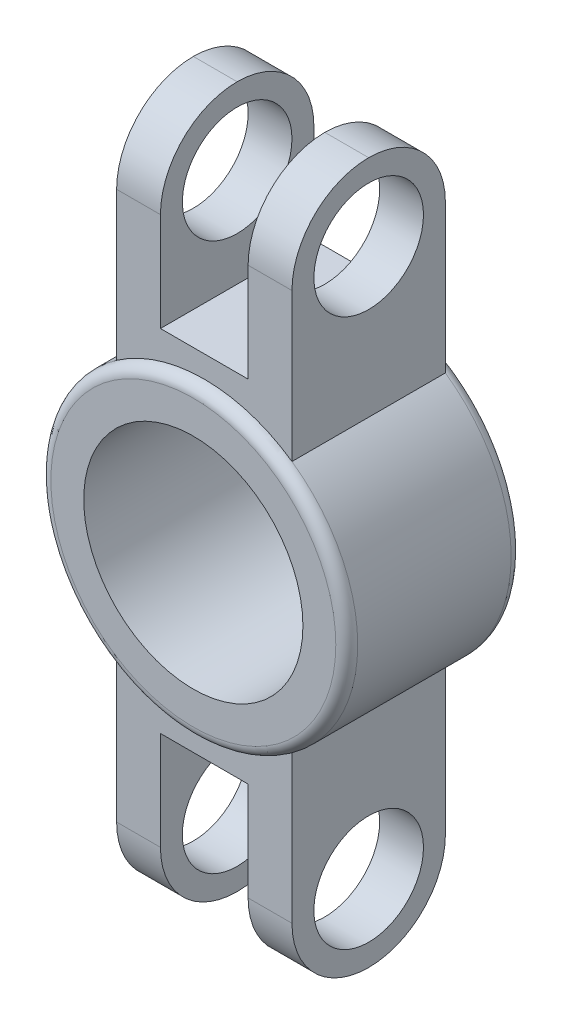
ISO-10303-21;
HEADER;
FILE_DESCRIPTION(('STEP AP214'),'2;1');
FILE_NAME('part.step','',(''),(''),'','','');
FILE_SCHEMA(('AUTOMOTIVE_DESIGN { 1 0 10303 214 1 1 1 1 }'));
ENDSEC;
DATA;
#1=APPLICATION_CONTEXT('core data for automotive mechanical design processes');
#2=APPLICATION_PROTOCOL_DEFINITION('international standard','automotive_design',2000,#1);
#3=PRODUCT_CONTEXT('',#1,'mechanical');
#4=PRODUCT('Part','Part','',(#3));
#5=PRODUCT_RELATED_PRODUCT_CATEGORY('part','',(#4));
#6=PRODUCT_DEFINITION_FORMATION('','',#4);
#7=PRODUCT_DEFINITION_CONTEXT('part definition',#1,'design');
#8=PRODUCT_DEFINITION('design','',#6,#7);
#9=PRODUCT_DEFINITION_SHAPE('','',#8);
#10=(LENGTH_UNIT() NAMED_UNIT(*) SI_UNIT(.MILLI.,.METRE.));
#11=(NAMED_UNIT(*) PLANE_ANGLE_UNIT() SI_UNIT($,.RADIAN.));
#12=(NAMED_UNIT(*) SI_UNIT($,.STERADIAN.) SOLID_ANGLE_UNIT());
#13=UNCERTAINTY_MEASURE_WITH_UNIT(LENGTH_MEASURE(1.E-05),#10,'distance_accuracy_value','');
#14=(GEOMETRIC_REPRESENTATION_CONTEXT(3) GLOBAL_UNCERTAINTY_ASSIGNED_CONTEXT((#13)) GLOBAL_UNIT_ASSIGNED_CONTEXT((#10,
#11,#12)) REPRESENTATION_CONTEXT('',''));
#15=CARTESIAN_POINT('',(0.,0.,0.));
#16=DIRECTION('',(0.,0.,1.));
#17=DIRECTION('',(1.,0.,0.));
#18=AXIS2_PLACEMENT_3D('',#15,#16,#17);
#19=CARTESIAN_POINT('',(5.08,-6.985,4.445));
#20=DIRECTION('',(-1.,0.,0.));
#21=DIRECTION('',(0.,0.,1.));
#22=AXIS2_PLACEMENT_3D('',#19,#20,#21);
#23=PLANE('',#22);
#24=CARTESIAN_POINT('',(5.08,-15.875,0.));
#25=DIRECTION('',(-1.,0.,0.));
#26=DIRECTION('',(0.,0.,1.));
#27=AXIS2_PLACEMENT_3D('',#24,#25,#26);
#28=CIRCLE('',#27,4.445);
#29=CARTESIAN_POINT('',(5.08,-15.875,4.445));
#30=VERTEX_POINT('',#29);
#31=CARTESIAN_POINT('',(5.08,-20.32,0.));
#32=VERTEX_POINT('',#31);
#33=EDGE_CURVE('E43',#30,#32,#28,.F.);
#34=ORIENTED_EDGE('',*,*,#33,.T.);
#35=CARTESIAN_POINT('',(5.08,-15.875,0.));
#36=DIRECTION('',(-1.,0.,0.));
#37=DIRECTION('',(0.,0.,1.));
#38=AXIS2_PLACEMENT_3D('',#35,#36,#37);
#39=CIRCLE('',#38,4.445);
#40=CARTESIAN_POINT('',(5.08,-15.875,-4.445));
#41=VERTEX_POINT('',#40);
#42=EDGE_CURVE('E11',#32,#41,#39,.F.);
#43=ORIENTED_EDGE('',*,*,#42,.T.);
#44=DIRECTION('',(0.,-1.,0.));
#45=VECTOR('',#44,1.);
#46=CARTESIAN_POINT('',(5.08,-6.985,-4.445));
#47=LINE('',#46,#45);
#48=CARTESIAN_POINT('',(5.08,-7.2955945611033,-4.445));
#49=VERTEX_POINT('',#48);
#50=EDGE_CURVE('E192',#49,#41,#47,.T.);
#51=ORIENTED_EDGE('',*,*,#50,.F.);
#52=DIRECTION('',(0.,0.,-1.));
#53=VECTOR('',#52,1.);
#54=CARTESIAN_POINT('',(5.08,-7.2955945611033,5.08));
#55=LINE('',#54,#53);
#56=CARTESIAN_POINT('',(5.08,-7.2955945611033,4.445));
#57=VERTEX_POINT('',#56);
#58=EDGE_CURVE('E191',#49,#57,#55,.F.);
#59=ORIENTED_EDGE('',*,*,#58,.T.);
#60=DIRECTION('',(0.,-1.,0.));
#61=VECTOR('',#60,1.);
#62=CARTESIAN_POINT('',(5.08,-6.985,4.445));
#63=LINE('',#62,#61);
#64=EDGE_CURVE('E198',#57,#30,#63,.T.);
#65=ORIENTED_EDGE('',*,*,#64,.T.);
#66=EDGE_LOOP('',(#34,#43,#51,#59,#65));
#67=FACE_BOUND('',#66,.T.);
#68=CARTESIAN_POINT('',(5.08,-15.875,0.));
#69=DIRECTION('',(-1.,0.,0.));
#70=DIRECTION('',(0.,0.,-1.));
#71=AXIS2_PLACEMENT_3D('',#68,#69,#70);
#72=CIRCLE('',#71,3.175);
#73=CARTESIAN_POINT('',(5.08,-15.875,-3.175));
#74=VERTEX_POINT('',#73);
#75=EDGE_CURVE('E347',#74,#74,#72,.T.);
#76=ORIENTED_EDGE('',*,*,#75,.T.);
#77=EDGE_LOOP('',(#76));
#78=FACE_BOUND('',#77,.T.);
#79=ADVANCED_FACE('F34',(#67,#78),#23,.F.);
#80=CARTESIAN_POINT('',(2.54,-6.985,4.445));
#81=DIRECTION('',(1.,0.,0.));
#82=DIRECTION('',(0.,0.,-1.));
#83=AXIS2_PLACEMENT_3D('',#80,#81,#82);
#84=PLANE('',#83);
#85=DIRECTION('',(0.,-1.,0.));
#86=VECTOR('',#85,1.);
#87=CARTESIAN_POINT('',(2.54,-6.985,-4.445));
#88=LINE('',#87,#86);
#89=CARTESIAN_POINT('',(2.54,-10.16,-4.445));
#90=VERTEX_POINT('',#89);
#91=CARTESIAN_POINT('',(2.54,-15.875,-4.445));
#92=VERTEX_POINT('',#91);
#93=EDGE_CURVE('E197',#90,#92,#88,.T.);
#94=ORIENTED_EDGE('',*,*,#93,.T.);
#95=CARTESIAN_POINT('',(2.54,-15.875,0.));
#96=DIRECTION('',(1.,0.,0.));
#97=DIRECTION('',(0.,0.,-1.));
#98=AXIS2_PLACEMENT_3D('',#95,#96,#97);
#99=CIRCLE('',#98,4.445);
#100=CARTESIAN_POINT('',(2.54,-20.32,0.));
#101=VERTEX_POINT('',#100);
#102=EDGE_CURVE('E57',#92,#101,#99,.F.);
#103=ORIENTED_EDGE('',*,*,#102,.T.);
#104=CARTESIAN_POINT('',(2.54,-15.875,0.));
#105=DIRECTION('',(1.,0.,0.));
#106=DIRECTION('',(0.,0.,-1.));
#107=AXIS2_PLACEMENT_3D('',#104,#105,#106);
#108=CIRCLE('',#107,4.445);
#109=CARTESIAN_POINT('',(2.54,-15.875,4.445));
#110=VERTEX_POINT('',#109);
#111=EDGE_CURVE('E196',#101,#110,#108,.F.);
#112=ORIENTED_EDGE('',*,*,#111,.T.);
#113=DIRECTION('',(0.,-1.,0.));
#114=VECTOR('',#113,1.);
#115=CARTESIAN_POINT('',(2.54,-6.985,4.445));
#116=LINE('',#115,#114);
#117=CARTESIAN_POINT('',(2.54,-10.16,4.445));
#118=VERTEX_POINT('',#117);
#119=EDGE_CURVE('E177',#118,#110,#116,.T.);
#120=ORIENTED_EDGE('',*,*,#119,.F.);
#121=DIRECTION('',(0.,0.,1.));
#122=VECTOR('',#121,1.);
#123=CARTESIAN_POINT('',(2.54,-10.16,4.445));
#124=LINE('',#123,#122);
#125=EDGE_CURVE('E187',#90,#118,#124,.T.);
#126=ORIENTED_EDGE('',*,*,#125,.F.);
#127=EDGE_LOOP('',(#94,#103,#112,#120,#126));
#128=FACE_BOUND('',#127,.T.);
#129=CARTESIAN_POINT('',(2.54,-15.875,0.));
#130=DIRECTION('',(1.,0.,0.));
#131=DIRECTION('',(0.,0.,-1.));
#132=AXIS2_PLACEMENT_3D('',#129,#130,#131);
#133=CIRCLE('',#132,3.175);
#134=CARTESIAN_POINT('',(2.54,-15.875,-3.175));
#135=VERTEX_POINT('',#134);
#136=EDGE_CURVE('E336',#135,#135,#133,.F.);
#137=ORIENTED_EDGE('',*,*,#136,.F.);
#138=EDGE_LOOP('',(#137));
#139=FACE_BOUND('',#138,.T.);
#140=ADVANCED_FACE('F194',(#128,#139),#84,.F.);
#141=CARTESIAN_POINT('',(-5.08,-6.985,4.445));
#142=DIRECTION('',(1.,0.,0.));
#143=DIRECTION('',(0.,0.,-1.));
#144=AXIS2_PLACEMENT_3D('',#141,#142,#143);
#145=PLANE('',#144);
#146=DIRECTION('',(0.,-1.,0.));
#147=VECTOR('',#146,1.);
#148=CARTESIAN_POINT('',(-5.08,-6.985,-4.445));
#149=LINE('',#148,#147);
#150=CARTESIAN_POINT('',(-5.08,-7.29559456110329,-4.445));
#151=VERTEX_POINT('',#150);
#152=CARTESIAN_POINT('',(-5.08,-15.875,-4.445));
#153=VERTEX_POINT('',#152);
#154=EDGE_CURVE('E353',#151,#153,#149,.T.);
#155=ORIENTED_EDGE('',*,*,#154,.T.);
#156=CARTESIAN_POINT('',(-5.08,-15.875,0.));
#157=DIRECTION('',(1.,0.,0.));
#158=DIRECTION('',(0.,0.,-1.));
#159=AXIS2_PLACEMENT_3D('',#156,#157,#158);
#160=CIRCLE('',#159,4.445);
#161=CARTESIAN_POINT('',(-5.08,-20.32,0.));
#162=VERTEX_POINT('',#161);
#163=EDGE_CURVE('E319',#153,#162,#160,.F.);
#164=ORIENTED_EDGE('',*,*,#163,.T.);
#165=CARTESIAN_POINT('',(-5.08,-15.875,0.));
#166=DIRECTION('',(1.,0.,0.));
#167=DIRECTION('',(0.,0.,-1.));
#168=AXIS2_PLACEMENT_3D('',#165,#166,#167);
#169=CIRCLE('',#168,4.445);
#170=CARTESIAN_POINT('',(-5.08,-15.875,4.445));
#171=VERTEX_POINT('',#170);
#172=EDGE_CURVE('E317',#162,#171,#169,.F.);
#173=ORIENTED_EDGE('',*,*,#172,.T.);
#174=DIRECTION('',(0.,-1.,0.));
#175=VECTOR('',#174,1.);
#176=CARTESIAN_POINT('',(-5.08,-6.985,4.445));
#177=LINE('',#176,#175);
#178=CARTESIAN_POINT('',(-5.08,-7.29559456110329,4.445));
#179=VERTEX_POINT('',#178);
#180=EDGE_CURVE('E356',#179,#171,#177,.T.);
#181=ORIENTED_EDGE('',*,*,#180,.F.);
#182=DIRECTION('',(0.,0.,-1.));
#183=VECTOR('',#182,1.);
#184=CARTESIAN_POINT('',(-5.08,-7.29559456110329,5.08));
#185=LINE('',#184,#183);
#186=EDGE_CURVE('E201',#179,#151,#185,.T.);
#187=ORIENTED_EDGE('',*,*,#186,.T.);
#188=EDGE_LOOP('',(#155,#164,#173,#181,#187));
#189=FACE_BOUND('',#188,.T.);
#190=CARTESIAN_POINT('',(-5.08,-15.875,0.));
#191=DIRECTION('',(-1.,0.,0.));
#192=DIRECTION('',(0.,0.,-1.));
#193=AXIS2_PLACEMENT_3D('',#190,#191,#192);
#194=CIRCLE('',#193,3.175);
#195=CARTESIAN_POINT('',(-5.08,-15.875,-3.175));
#196=VERTEX_POINT('',#195);
#197=EDGE_CURVE('E344',#196,#196,#194,.T.);
#198=ORIENTED_EDGE('',*,*,#197,.F.);
#199=EDGE_LOOP('',(#198));
#200=FACE_BOUND('',#199,.T.);
#201=ADVANCED_FACE('F382',(#189,#200),#145,.F.);
#202=CARTESIAN_POINT('',(-2.54,-6.985,4.445));
#203=DIRECTION('',(-1.,0.,0.));
#204=DIRECTION('',(0.,0.,1.));
#205=AXIS2_PLACEMENT_3D('',#202,#203,#204);
#206=PLANE('',#205);
#207=CARTESIAN_POINT('',(-2.54,-15.875,0.));
#208=DIRECTION('',(-1.,0.,0.));
#209=DIRECTION('',(0.,0.,1.));
#210=AXIS2_PLACEMENT_3D('',#207,#208,#209);
#211=CIRCLE('',#210,4.445);
#212=CARTESIAN_POINT('',(-2.54,-15.875,4.445));
#213=VERTEX_POINT('',#212);
#214=CARTESIAN_POINT('',(-2.54,-20.32,0.));
#215=VERTEX_POINT('',#214);
#216=EDGE_CURVE('E321',#213,#215,#211,.F.);
#217=ORIENTED_EDGE('',*,*,#216,.T.);
#218=CARTESIAN_POINT('',(-2.54,-15.875,0.));
#219=DIRECTION('',(-1.,0.,0.));
#220=DIRECTION('',(0.,0.,1.));
#221=AXIS2_PLACEMENT_3D('',#218,#219,#220);
#222=CIRCLE('',#221,4.445);
#223=CARTESIAN_POINT('',(-2.54,-15.875,-4.445));
#224=VERTEX_POINT('',#223);
#225=EDGE_CURVE('E323',#215,#224,#222,.F.);
#226=ORIENTED_EDGE('',*,*,#225,.T.);
#227=DIRECTION('',(0.,-1.,0.));
#228=VECTOR('',#227,1.);
#229=CARTESIAN_POINT('',(-2.54,-6.985,-4.445));
#230=LINE('',#229,#228);
#231=CARTESIAN_POINT('',(-2.54,-10.16,-4.445));
#232=VERTEX_POINT('',#231);
#233=EDGE_CURVE('E349',#232,#224,#230,.T.);
#234=ORIENTED_EDGE('',*,*,#233,.F.);
#235=DIRECTION('',(0.,0.,-1.));
#236=VECTOR('',#235,1.);
#237=CARTESIAN_POINT('',(-2.54,-10.16,4.445));
#238=LINE('',#237,#236);
#239=CARTESIAN_POINT('',(-2.54,-10.16,4.445));
#240=VERTEX_POINT('',#239);
#241=EDGE_CURVE('E352',#240,#232,#238,.T.);
#242=ORIENTED_EDGE('',*,*,#241,.F.);
#243=DIRECTION('',(0.,-1.,0.));
#244=VECTOR('',#243,1.);
#245=CARTESIAN_POINT('',(-2.54,-6.985,4.445));
#246=LINE('',#245,#244);
#247=EDGE_CURVE('E180',#240,#213,#246,.T.);
#248=ORIENTED_EDGE('',*,*,#247,.T.);
#249=EDGE_LOOP('',(#217,#226,#234,#242,#248));
#250=FACE_BOUND('',#249,.T.);
#251=CARTESIAN_POINT('',(-2.54,-15.875,0.));
#252=DIRECTION('',(-1.,0.,0.));
#253=DIRECTION('',(0.,0.,1.));
#254=AXIS2_PLACEMENT_3D('',#251,#252,#253);
#255=CIRCLE('',#254,3.175);
#256=CARTESIAN_POINT('',(-2.54,-15.875,3.175));
#257=VERTEX_POINT('',#256);
#258=EDGE_CURVE('E38',#257,#257,#255,.F.);
#259=ORIENTED_EDGE('',*,*,#258,.F.);
#260=EDGE_LOOP('',(#259));
#261=FACE_BOUND('',#260,.T.);
#262=ADVANCED_FACE('F384',(#250,#261),#206,.F.);
#263=CARTESIAN_POINT('',(3.81,-10.16,4.445));
#264=DIRECTION('',(0.,-1.,0.));
#265=DIRECTION('',(0.,0.,-1.));
#266=AXIS2_PLACEMENT_3D('',#263,#264,#265);
#267=PLANE('',#266);
#268=DIRECTION('',(-1.,0.,0.));
#269=VECTOR('',#268,1.);
#270=CARTESIAN_POINT('',(3.81,-10.16,4.445));
#271=LINE('',#270,#269);
#272=EDGE_CURVE('E172',#118,#240,#271,.T.);
#273=ORIENTED_EDGE('',*,*,#272,.T.);
#274=ORIENTED_EDGE('',*,*,#241,.T.);
#275=DIRECTION('',(-1.,0.,0.));
#276=VECTOR('',#275,1.);
#277=CARTESIAN_POINT('',(3.81,-10.16,-4.445));
#278=LINE('',#277,#276);
#279=EDGE_CURVE('E184',#90,#232,#278,.T.);
#280=ORIENTED_EDGE('',*,*,#279,.F.);
#281=ORIENTED_EDGE('',*,*,#125,.T.);
#282=EDGE_LOOP('',(#273,#274,#280,#281));
#283=FACE_BOUND('',#282,.T.);
#284=ADVANCED_FACE('F188',(#283),#267,.T.);
#285=CARTESIAN_POINT('',(0.,0.,5.08));
#286=DIRECTION('',(0.,0.,-1.));
#287=DIRECTION('',(-1.,0.,0.));
#288=AXIS2_PLACEMENT_3D('',#285,#286,#287);
#289=CYLINDRICAL_SURFACE('',#288,8.89);
#290=ORIENTED_EDGE('',*,*,#186,.F.);
#291=CARTESIAN_POINT('',(0.,0.,4.445));
#292=DIRECTION('',(0.,0.,1.));
#293=DIRECTION('',(1.,0.,0.));
#294=AXIS2_PLACEMENT_3D('',#291,#292,#293);
#295=CIRCLE('',#294,8.89);
#296=CARTESIAN_POINT('',(-5.08,7.29559456110329,4.445));
#297=VERTEX_POINT('',#296);
#298=EDGE_CURVE('E258',#179,#297,#295,.F.);
#299=ORIENTED_EDGE('',*,*,#298,.T.);
#300=DIRECTION('',(0.,0.,-1.));
#301=VECTOR('',#300,1.);
#302=CARTESIAN_POINT('',(-5.08,7.29559456110329,5.08));
#303=LINE('',#302,#301);
#304=CARTESIAN_POINT('',(-5.08,7.29559456110329,-4.445));
#305=VERTEX_POINT('',#304);
#306=EDGE_CURVE('E221',#297,#305,#303,.T.);
#307=ORIENTED_EDGE('',*,*,#306,.T.);
#308=CARTESIAN_POINT('',(0.,0.,-4.445));
#309=DIRECTION('',(0.,0.,1.));
#310=DIRECTION('',(1.,0.,0.));
#311=AXIS2_PLACEMENT_3D('',#308,#309,#310);
#312=CIRCLE('',#311,8.89);
#313=EDGE_CURVE('E268',#305,#151,#312,.T.);
#314=ORIENTED_EDGE('',*,*,#313,.T.);
#315=EDGE_LOOP('',(#290,#299,#307,#314));
#316=FACE_BOUND('',#315,.T.);
#317=ADVANCED_FACE('F402',(#316),#289,.T.);
#318=ORIENTED_EDGE('',*,*,#58,.F.);
#319=CARTESIAN_POINT('',(5.08,7.2955945611033,-4.445));
#320=VERTEX_POINT('',#319);
#321=EDGE_CURVE('E263',#49,#320,#312,.T.);
#322=ORIENTED_EDGE('',*,*,#321,.T.);
#323=DIRECTION('',(0.,0.,-1.));
#324=VECTOR('',#323,1.);
#325=CARTESIAN_POINT('',(5.08,7.2955945611033,5.08));
#326=LINE('',#325,#324);
#327=CARTESIAN_POINT('',(5.08,7.2955945611033,4.445));
#328=VERTEX_POINT('',#327);
#329=EDGE_CURVE('E238',#320,#328,#326,.F.);
#330=ORIENTED_EDGE('',*,*,#329,.T.);
#331=EDGE_CURVE('E264',#328,#57,#295,.F.);
#332=ORIENTED_EDGE('',*,*,#331,.T.);
#333=EDGE_LOOP('',(#318,#322,#330,#332));
#334=FACE_BOUND('',#333,.T.);
#335=ADVANCED_FACE('F450',(#334),#289,.T.);
#336=CARTESIAN_POINT('',(0.,0.,5.08));
#337=DIRECTION('',(0.,0.,1.));
#338=DIRECTION('',(1.,0.,0.));
#339=AXIS2_PLACEMENT_3D('',#336,#337,#338);
#340=PLANE('',#339);
#341=CARTESIAN_POINT('',(0.,0.,5.08));
#342=DIRECTION('',(0.,0.,1.));
#343=DIRECTION('',(1.,0.,0.));
#344=AXIS2_PLACEMENT_3D('',#341,#342,#343);
#345=CIRCLE('',#344,8.255);
#346=CARTESIAN_POINT('',(8.255,0.,5.08));
#347=VERTEX_POINT('',#346);
#348=EDGE_CURVE('E271',#347,#347,#345,.T.);
#349=ORIENTED_EDGE('',*,*,#348,.T.);
#350=EDGE_LOOP('',(#349));
#351=FACE_BOUND('',#350,.T.);
#352=CARTESIAN_POINT('',(0.,0.,5.08));
#353=DIRECTION('',(0.,0.,1.));
#354=DIRECTION('',(1.,0.,0.));
#355=AXIS2_PLACEMENT_3D('',#352,#353,#354);
#356=CIRCLE('',#355,6.35);
#357=CARTESIAN_POINT('',(6.35,0.,5.08));
#358=VERTEX_POINT('',#357);
#359=EDGE_CURVE('E255',#358,#358,#356,.T.);
#360=ORIENTED_EDGE('',*,*,#359,.F.);
#361=EDGE_LOOP('',(#360));
#362=FACE_BOUND('',#361,.T.);
#363=ADVANCED_FACE('F447',(#351,#362),#340,.T.);
#364=CARTESIAN_POINT('',(0.,0.,-5.08));
#365=DIRECTION('',(0.,0.,1.));
#366=DIRECTION('',(1.,0.,0.));
#367=AXIS2_PLACEMENT_3D('',#364,#365,#366);
#368=PLANE('',#367);
#369=CARTESIAN_POINT('',(0.,0.,-5.08));
#370=DIRECTION('',(0.,0.,1.));
#371=DIRECTION('',(1.,0.,0.));
#372=AXIS2_PLACEMENT_3D('',#369,#370,#371);
#373=CIRCLE('',#372,8.255);
#374=CARTESIAN_POINT('',(8.255,0.,-5.08));
#375=VERTEX_POINT('',#374);
#376=EDGE_CURVE('E267',#375,#375,#373,.F.);
#377=ORIENTED_EDGE('',*,*,#376,.T.);
#378=EDGE_LOOP('',(#377));
#379=FACE_BOUND('',#378,.T.);
#380=CARTESIAN_POINT('',(0.,0.,-5.08));
#381=DIRECTION('',(0.,0.,1.));
#382=DIRECTION('',(1.,0.,0.));
#383=AXIS2_PLACEMENT_3D('',#380,#381,#382);
#384=CIRCLE('',#383,6.35);
#385=CARTESIAN_POINT('',(6.35,0.,-5.08));
#386=VERTEX_POINT('',#385);
#387=EDGE_CURVE('E254',#386,#386,#384,.T.);
#388=ORIENTED_EDGE('',*,*,#387,.T.);
#389=EDGE_LOOP('',(#388));
#390=FACE_BOUND('',#389,.T.);
#391=ADVANCED_FACE('F445',(#379,#390),#368,.F.);
#392=CARTESIAN_POINT('',(0.,0.,5.08));
#393=DIRECTION('',(0.,0.,-1.));
#394=DIRECTION('',(-1.,0.,0.));
#395=AXIS2_PLACEMENT_3D('',#392,#393,#394);
#396=CYLINDRICAL_SURFACE('',#395,6.35);
#397=ORIENTED_EDGE('',*,*,#359,.T.);
#398=EDGE_LOOP('',(#397));
#399=FACE_BOUND('',#398,.T.);
#400=ORIENTED_EDGE('',*,*,#387,.F.);
#401=EDGE_LOOP('',(#400));
#402=FACE_BOUND('',#401,.T.);
#403=ADVANCED_FACE('F441',(#399,#402),#396,.F.);
#404=CARTESIAN_POINT('',(0.,0.,-4.445));
#405=DIRECTION('',(0.,0.,1.));
#406=DIRECTION('',(1.,0.,0.));
#407=AXIS2_PLACEMENT_3D('',#404,#405,#406);
#408=TOROIDAL_SURFACE('',#407,8.255,0.635);
#409=ORIENTED_EDGE('',*,*,#376,.F.);
#410=EDGE_LOOP('',(#409));
#411=FACE_BOUND('',#410,.T.);
#412=EDGE_CURVE('E265',#320,#305,#312,.T.);
#413=ORIENTED_EDGE('',*,*,#412,.F.);
#414=ORIENTED_EDGE('',*,*,#321,.F.);
#415=EDGE_CURVE('E367',#151,#49,#312,.T.);
#416=ORIENTED_EDGE('',*,*,#415,.F.);
#417=ORIENTED_EDGE('',*,*,#313,.F.);
#418=EDGE_LOOP('',(#413,#414,#416,#417));
#419=FACE_BOUND('',#418,.T.);
#420=ADVANCED_FACE('F444',(#411,#419),#408,.T.);
#421=CARTESIAN_POINT('',(0.,0.,4.445));
#422=DIRECTION('',(0.,0.,1.));
#423=DIRECTION('',(1.,0.,0.));
#424=AXIS2_PLACEMENT_3D('',#421,#422,#423);
#425=TOROIDAL_SURFACE('',#424,8.255,0.635);
#426=EDGE_CURVE('E261',#297,#328,#295,.F.);
#427=ORIENTED_EDGE('',*,*,#426,.F.);
#428=ORIENTED_EDGE('',*,*,#298,.F.);
#429=EDGE_CURVE('E516',#57,#179,#295,.F.);
#430=ORIENTED_EDGE('',*,*,#429,.F.);
#431=ORIENTED_EDGE('',*,*,#331,.F.);
#432=EDGE_LOOP('',(#427,#428,#430,#431));
#433=FACE_BOUND('',#432,.T.);
#434=ORIENTED_EDGE('',*,*,#348,.F.);
#435=EDGE_LOOP('',(#434));
#436=FACE_BOUND('',#435,.T.);
#437=ADVANCED_FACE('F439',(#433,#436),#425,.T.);
#438=CARTESIAN_POINT('',(3.81,6.35,4.445));
#439=DIRECTION('',(0.,0.,-1.));
#440=DIRECTION('',(-1.,0.,0.));
#441=AXIS2_PLACEMENT_3D('',#438,#439,#440);
#442=PLANE('',#441);
#443=DIRECTION('',(0.,1.,0.));
#444=VECTOR('',#443,1.);
#445=CARTESIAN_POINT('',(-2.54,6.985,4.445));
#446=LINE('',#445,#444);
#447=CARTESIAN_POINT('',(-2.54,10.16,4.445));
#448=VERTEX_POINT('',#447);
#449=CARTESIAN_POINT('',(-2.54,15.875,4.445));
#450=VERTEX_POINT('',#449);
#451=EDGE_CURVE('E218',#448,#450,#446,.T.);
#452=ORIENTED_EDGE('',*,*,#451,.T.);
#453=DIRECTION('',(1.,0.,0.));
#454=VECTOR('',#453,1.);
#455=CARTESIAN_POINT('',(3.81,15.875,4.445));
#456=LINE('',#455,#454);
#457=CARTESIAN_POINT('',(-5.08,15.875,4.445));
#458=VERTEX_POINT('',#457);
#459=EDGE_CURVE('E295',#450,#458,#456,.F.);
#460=ORIENTED_EDGE('',*,*,#459,.T.);
#461=DIRECTION('',(0.,1.,0.));
#462=VECTOR('',#461,1.);
#463=CARTESIAN_POINT('',(-5.08,6.985,4.445));
#464=LINE('',#463,#462);
#465=EDGE_CURVE('E222',#297,#458,#464,.T.);
#466=ORIENTED_EDGE('',*,*,#465,.F.);
#467=ORIENTED_EDGE('',*,*,#426,.T.);
#468=DIRECTION('',(0.,1.,0.));
#469=VECTOR('',#468,1.);
#470=CARTESIAN_POINT('',(5.08,6.985,4.445));
#471=LINE('',#470,#469);
#472=CARTESIAN_POINT('',(5.08,15.875,4.445));
#473=VERTEX_POINT('',#472);
#474=EDGE_CURVE('E235',#328,#473,#471,.T.);
#475=ORIENTED_EDGE('',*,*,#474,.T.);
#476=DIRECTION('',(1.,0.,0.));
#477=VECTOR('',#476,1.);
#478=CARTESIAN_POINT('',(3.81,15.875,4.445));
#479=LINE('',#478,#477);
#480=CARTESIAN_POINT('',(2.54,15.875,4.445));
#481=VERTEX_POINT('',#480);
#482=EDGE_CURVE('E293',#473,#481,#479,.F.);
#483=ORIENTED_EDGE('',*,*,#482,.T.);
#484=DIRECTION('',(0.,1.,0.));
#485=VECTOR('',#484,1.);
#486=CARTESIAN_POINT('',(2.54,6.985,4.445));
#487=LINE('',#486,#485);
#488=CARTESIAN_POINT('',(2.54,10.16,4.445));
#489=VERTEX_POINT('',#488);
#490=EDGE_CURVE('E239',#489,#481,#487,.T.);
#491=ORIENTED_EDGE('',*,*,#490,.F.);
#492=DIRECTION('',(-1.,0.,0.));
#493=VECTOR('',#492,1.);
#494=CARTESIAN_POINT('',(3.81,10.16,4.445));
#495=LINE('',#494,#493);
#496=EDGE_CURVE('E249',#489,#448,#495,.T.);
#497=ORIENTED_EDGE('',*,*,#496,.T.);
#498=EDGE_LOOP('',(#452,#460,#466,#467,#475,#483,#491,#497));
#499=FACE_BOUND('',#498,.T.);
#500=ADVANCED_FACE('F435',(#499),#442,.F.);
#501=CARTESIAN_POINT('',(3.81,6.35,-4.445));
#502=DIRECTION('',(0.,0.,1.));
#503=DIRECTION('',(1.,0.,0.));
#504=AXIS2_PLACEMENT_3D('',#501,#502,#503);
#505=PLANE('',#504);
#506=DIRECTION('',(0.,1.,0.));
#507=VECTOR('',#506,1.);
#508=CARTESIAN_POINT('',(-5.08,6.985,-4.445));
#509=LINE('',#508,#507);
#510=CARTESIAN_POINT('',(-5.08,15.875,-4.445));
#511=VERTEX_POINT('',#510);
#512=EDGE_CURVE('E225',#305,#511,#509,.T.);
#513=ORIENTED_EDGE('',*,*,#512,.T.);
#514=DIRECTION('',(-1.,0.,0.));
#515=VECTOR('',#514,1.);
#516=CARTESIAN_POINT('',(3.81,15.875,-4.445));
#517=LINE('',#516,#515);
#518=CARTESIAN_POINT('',(-2.54,15.875,-4.445));
#519=VERTEX_POINT('',#518);
#520=EDGE_CURVE('E286',#511,#519,#517,.F.);
#521=ORIENTED_EDGE('',*,*,#520,.T.);
#522=DIRECTION('',(0.,1.,0.));
#523=VECTOR('',#522,1.);
#524=CARTESIAN_POINT('',(-2.54,6.985,-4.445));
#525=LINE('',#524,#523);
#526=CARTESIAN_POINT('',(-2.54,10.16,-4.445));
#527=VERTEX_POINT('',#526);
#528=EDGE_CURVE('E228',#527,#519,#525,.T.);
#529=ORIENTED_EDGE('',*,*,#528,.F.);
#530=DIRECTION('',(-1.,0.,0.));
#531=VECTOR('',#530,1.);
#532=CARTESIAN_POINT('',(3.81,10.16,-4.445));
#533=LINE('',#532,#531);
#534=CARTESIAN_POINT('',(2.54,10.16,-4.445));
#535=VERTEX_POINT('',#534);
#536=EDGE_CURVE('E252',#535,#527,#533,.T.);
#537=ORIENTED_EDGE('',*,*,#536,.F.);
#538=DIRECTION('',(0.,1.,0.));
#539=VECTOR('',#538,1.);
#540=CARTESIAN_POINT('',(2.54,6.985,-4.445));
#541=LINE('',#540,#539);
#542=CARTESIAN_POINT('',(2.54,15.875,-4.445));
#543=VERTEX_POINT('',#542);
#544=EDGE_CURVE('E242',#535,#543,#541,.T.);
#545=ORIENTED_EDGE('',*,*,#544,.T.);
#546=DIRECTION('',(-1.,0.,0.));
#547=VECTOR('',#546,1.);
#548=CARTESIAN_POINT('',(3.81,15.875,-4.445));
#549=LINE('',#548,#547);
#550=CARTESIAN_POINT('',(5.08,15.875,-4.445));
#551=VERTEX_POINT('',#550);
#552=EDGE_CURVE('E283',#543,#551,#549,.F.);
#553=ORIENTED_EDGE('',*,*,#552,.T.);
#554=DIRECTION('',(0.,1.,0.));
#555=VECTOR('',#554,1.);
#556=CARTESIAN_POINT('',(5.08,6.985,-4.445));
#557=LINE('',#556,#555);
#558=EDGE_CURVE('E234',#320,#551,#557,.T.);
#559=ORIENTED_EDGE('',*,*,#558,.F.);
#560=ORIENTED_EDGE('',*,*,#412,.T.);
#561=EDGE_LOOP('',(#513,#521,#529,#537,#545,#553,#559,#560));
#562=FACE_BOUND('',#561,.T.);
#563=ADVANCED_FACE('F431',(#562),#505,.F.);
#564=CARTESIAN_POINT('',(3.81,10.16,4.445));
#565=DIRECTION('',(0.,-1.,0.));
#566=DIRECTION('',(0.,0.,-1.));
#567=AXIS2_PLACEMENT_3D('',#564,#565,#566);
#568=PLANE('',#567);
#569=ORIENTED_EDGE('',*,*,#536,.T.);
#570=DIRECTION('',(0.,0.,1.));
#571=VECTOR('',#570,1.);
#572=CARTESIAN_POINT('',(-2.54,10.16,4.445));
#573=LINE('',#572,#571);
#574=EDGE_CURVE('E277',#527,#448,#573,.T.);
#575=ORIENTED_EDGE('',*,*,#574,.T.);
#576=ORIENTED_EDGE('',*,*,#496,.F.);
#577=DIRECTION('',(0.,0.,-1.));
#578=VECTOR('',#577,1.);
#579=CARTESIAN_POINT('',(2.54,10.16,4.445));
#580=LINE('',#579,#578);
#581=EDGE_CURVE('E274',#489,#535,#580,.T.);
#582=ORIENTED_EDGE('',*,*,#581,.T.);
#583=EDGE_LOOP('',(#569,#575,#576,#582));
#584=FACE_BOUND('',#583,.T.);
#585=ADVANCED_FACE('F427',(#584),#568,.F.);
#586=CARTESIAN_POINT('',(5.08,6.985,4.445));
#587=DIRECTION('',(1.,0.,0.));
#588=DIRECTION('',(0.,0.,-1.));
#589=AXIS2_PLACEMENT_3D('',#586,#587,#588);
#590=PLANE('',#589);
#591=CARTESIAN_POINT('',(5.08,15.875,0.));
#592=DIRECTION('',(1.,0.,0.));
#593=DIRECTION('',(0.,0.,-1.));
#594=AXIS2_PLACEMENT_3D('',#591,#592,#593);
#595=CIRCLE('',#594,3.175);
#596=CARTESIAN_POINT('',(5.08,15.875,-3.175));
#597=VERTEX_POINT('',#596);
#598=EDGE_CURVE('E183',#597,#597,#595,.T.);
#599=ORIENTED_EDGE('',*,*,#598,.F.);
#600=EDGE_LOOP('',(#599));
#601=FACE_BOUND('',#600,.T.);
#602=ORIENTED_EDGE('',*,*,#558,.T.);
#603=CARTESIAN_POINT('',(5.08,15.875,0.));
#604=DIRECTION('',(1.,0.,0.));
#605=DIRECTION('',(0.,0.,-1.));
#606=AXIS2_PLACEMENT_3D('',#603,#604,#605);
#607=CIRCLE('',#606,4.445);
#608=CARTESIAN_POINT('',(5.08,20.32,0.));
#609=VERTEX_POINT('',#608);
#610=EDGE_CURVE('E303',#551,#609,#607,.T.);
#611=ORIENTED_EDGE('',*,*,#610,.T.);
#612=CARTESIAN_POINT('',(5.08,15.875,0.));
#613=DIRECTION('',(1.,0.,0.));
#614=DIRECTION('',(0.,0.,-1.));
#615=AXIS2_PLACEMENT_3D('',#612,#613,#614);
#616=CIRCLE('',#615,4.445);
#617=EDGE_CURVE('E301',#609,#473,#616,.T.);
#618=ORIENTED_EDGE('',*,*,#617,.T.);
#619=ORIENTED_EDGE('',*,*,#474,.F.);
#620=ORIENTED_EDGE('',*,*,#329,.F.);
#621=EDGE_LOOP('',(#602,#611,#618,#619,#620));
#622=FACE_BOUND('',#621,.T.);
#623=ADVANCED_FACE('F423',(#601,#622),#590,.T.);
#624=CARTESIAN_POINT('',(2.54,6.985,4.445));
#625=DIRECTION('',(-1.,0.,0.));
#626=DIRECTION('',(0.,0.,1.));
#627=AXIS2_PLACEMENT_3D('',#624,#625,#626);
#628=PLANE('',#627);
#629=CARTESIAN_POINT('',(2.54,15.875,0.));
#630=DIRECTION('',(-1.,0.,0.));
#631=DIRECTION('',(0.,0.,1.));
#632=AXIS2_PLACEMENT_3D('',#629,#630,#631);
#633=CIRCLE('',#632,3.175);
#634=CARTESIAN_POINT('',(2.54,15.875,3.175));
#635=VERTEX_POINT('',#634);
#636=EDGE_CURVE('E214',#635,#635,#633,.T.);
#637=ORIENTED_EDGE('',*,*,#636,.F.);
#638=EDGE_LOOP('',(#637));
#639=FACE_BOUND('',#638,.T.);
#640=CARTESIAN_POINT('',(2.54,15.875,0.));
#641=DIRECTION('',(-1.,0.,0.));
#642=DIRECTION('',(0.,0.,1.));
#643=AXIS2_PLACEMENT_3D('',#640,#641,#642);
#644=CIRCLE('',#643,4.445);
#645=CARTESIAN_POINT('',(2.54,20.32,0.));
#646=VERTEX_POINT('',#645);
#647=EDGE_CURVE('E297',#481,#646,#644,.T.);
#648=ORIENTED_EDGE('',*,*,#647,.T.);
#649=CARTESIAN_POINT('',(2.54,15.875,0.));
#650=DIRECTION('',(-1.,0.,0.));
#651=DIRECTION('',(0.,0.,1.));
#652=AXIS2_PLACEMENT_3D('',#649,#650,#651);
#653=CIRCLE('',#652,4.445);
#654=EDGE_CURVE('E299',#646,#543,#653,.T.);
#655=ORIENTED_EDGE('',*,*,#654,.T.);
#656=ORIENTED_EDGE('',*,*,#544,.F.);
#657=ORIENTED_EDGE('',*,*,#581,.F.);
#658=ORIENTED_EDGE('',*,*,#490,.T.);
#659=EDGE_LOOP('',(#648,#655,#656,#657,#658));
#660=FACE_BOUND('',#659,.T.);
#661=ADVANCED_FACE('F415',(#639,#660),#628,.T.);
#662=CARTESIAN_POINT('',(-5.08,6.985,4.445));
#663=DIRECTION('',(-1.,0.,0.));
#664=DIRECTION('',(0.,0.,1.));
#665=AXIS2_PLACEMENT_3D('',#662,#663,#664);
#666=PLANE('',#665);
#667=CARTESIAN_POINT('',(-5.08,15.875,0.));
#668=DIRECTION('',(1.,0.,0.));
#669=DIRECTION('',(0.,0.,-1.));
#670=AXIS2_PLACEMENT_3D('',#667,#668,#669);
#671=CIRCLE('',#670,3.175);
#672=CARTESIAN_POINT('',(-5.08,15.875,-3.175));
#673=VERTEX_POINT('',#672);
#674=EDGE_CURVE('E208',#673,#673,#671,.T.);
#675=ORIENTED_EDGE('',*,*,#674,.T.);
#676=EDGE_LOOP('',(#675));
#677=FACE_BOUND('',#676,.T.);
#678=CARTESIAN_POINT('',(-5.08,15.875,0.));
#679=DIRECTION('',(-1.,0.,0.));
#680=DIRECTION('',(0.,0.,1.));
#681=AXIS2_PLACEMENT_3D('',#678,#679,#680);
#682=CIRCLE('',#681,4.445);
#683=CARTESIAN_POINT('',(-5.08,20.32,0.));
#684=VERTEX_POINT('',#683);
#685=EDGE_CURVE('E279',#458,#684,#682,.T.);
#686=ORIENTED_EDGE('',*,*,#685,.T.);
#687=CARTESIAN_POINT('',(-5.08,15.875,0.));
#688=DIRECTION('',(-1.,0.,0.));
#689=DIRECTION('',(0.,0.,1.));
#690=AXIS2_PLACEMENT_3D('',#687,#688,#689);
#691=CIRCLE('',#690,4.445);
#692=EDGE_CURVE('E281',#684,#511,#691,.T.);
#693=ORIENTED_EDGE('',*,*,#692,.T.);
#694=ORIENTED_EDGE('',*,*,#512,.F.);
#695=ORIENTED_EDGE('',*,*,#306,.F.);
#696=ORIENTED_EDGE('',*,*,#465,.T.);
#697=EDGE_LOOP('',(#686,#693,#694,#695,#696));
#698=FACE_BOUND('',#697,.T.);
#699=ADVANCED_FACE('F411',(#677,#698),#666,.T.);
#700=CARTESIAN_POINT('',(-2.54,6.985,4.445));
#701=DIRECTION('',(1.,0.,0.));
#702=DIRECTION('',(0.,0.,-1.));
#703=AXIS2_PLACEMENT_3D('',#700,#701,#702);
#704=PLANE('',#703);
#705=CARTESIAN_POINT('',(-2.54,15.875,0.));
#706=DIRECTION('',(1.,0.,0.));
#707=DIRECTION('',(0.,0.,-1.));
#708=AXIS2_PLACEMENT_3D('',#705,#706,#707);
#709=CIRCLE('',#708,3.175);
#710=CARTESIAN_POINT('',(-2.54,15.875,-3.175));
#711=VERTEX_POINT('',#710);
#712=EDGE_CURVE('E211',#711,#711,#709,.T.);
#713=ORIENTED_EDGE('',*,*,#712,.F.);
#714=EDGE_LOOP('',(#713));
#715=FACE_BOUND('',#714,.T.);
#716=ORIENTED_EDGE('',*,*,#528,.T.);
#717=CARTESIAN_POINT('',(-2.54,15.875,0.));
#718=DIRECTION('',(1.,0.,0.));
#719=DIRECTION('',(0.,0.,-1.));
#720=AXIS2_PLACEMENT_3D('',#717,#718,#719);
#721=CIRCLE('',#720,4.445);
#722=CARTESIAN_POINT('',(-2.54,20.32,0.));
#723=VERTEX_POINT('',#722);
#724=EDGE_CURVE('E291',#519,#723,#721,.T.);
#725=ORIENTED_EDGE('',*,*,#724,.T.);
#726=CARTESIAN_POINT('',(-2.54,15.875,0.));
#727=DIRECTION('',(1.,0.,0.));
#728=DIRECTION('',(0.,0.,-1.));
#729=AXIS2_PLACEMENT_3D('',#726,#727,#728);
#730=CIRCLE('',#729,4.445);
#731=EDGE_CURVE('E289',#723,#450,#730,.T.);
#732=ORIENTED_EDGE('',*,*,#731,.T.);
#733=ORIENTED_EDGE('',*,*,#451,.F.);
#734=ORIENTED_EDGE('',*,*,#574,.F.);
#735=EDGE_LOOP('',(#716,#725,#732,#733,#734));
#736=FACE_BOUND('',#735,.T.);
#737=ADVANCED_FACE('F414',(#715,#736),#704,.T.);
#738=CARTESIAN_POINT('',(0.,15.875,0.));
#739=DIRECTION('',(1.,0.,0.));
#740=DIRECTION('',(0.,0.,-1.));
#741=AXIS2_PLACEMENT_3D('',#738,#739,#740);
#742=CYLINDRICAL_SURFACE('',#741,4.445);
#743=ORIENTED_EDGE('',*,*,#459,.F.);
#744=ORIENTED_EDGE('',*,*,#731,.F.);
#745=DIRECTION('',(1.,0.,0.));
#746=VECTOR('',#745,1.);
#747=CARTESIAN_POINT('',(0.,20.32,0.));
#748=LINE('',#747,#746);
#749=EDGE_CURVE('E231',#684,#723,#748,.T.);
#750=ORIENTED_EDGE('',*,*,#749,.F.);
#751=ORIENTED_EDGE('',*,*,#685,.F.);
#752=EDGE_LOOP('',(#743,#744,#750,#751));
#753=FACE_BOUND('',#752,.T.);
#754=ADVANCED_FACE('F419',(#753),#742,.T.);
#755=CARTESIAN_POINT('',(0.,15.875,0.));
#756=DIRECTION('',(-1.,0.,0.));
#757=DIRECTION('',(0.,0.,1.));
#758=AXIS2_PLACEMENT_3D('',#755,#756,#757);
#759=CYLINDRICAL_SURFACE('',#758,4.445);
#760=ORIENTED_EDGE('',*,*,#724,.F.);
#761=ORIENTED_EDGE('',*,*,#520,.F.);
#762=ORIENTED_EDGE('',*,*,#692,.F.);
#763=ORIENTED_EDGE('',*,*,#749,.T.);
#764=EDGE_LOOP('',(#760,#761,#762,#763));
#765=FACE_BOUND('',#764,.T.);
#766=ADVANCED_FACE('F464',(#765),#759,.T.);
#767=CARTESIAN_POINT('',(0.,15.875,0.));
#768=DIRECTION('',(1.,0.,0.));
#769=DIRECTION('',(0.,0.,-1.));
#770=AXIS2_PLACEMENT_3D('',#767,#768,#769);
#771=CYLINDRICAL_SURFACE('',#770,4.445);
#772=ORIENTED_EDGE('',*,*,#482,.F.);
#773=ORIENTED_EDGE('',*,*,#617,.F.);
#774=DIRECTION('',(1.,0.,0.));
#775=VECTOR('',#774,1.);
#776=CARTESIAN_POINT('',(0.,20.32,0.));
#777=LINE('',#776,#775);
#778=EDGE_CURVE('E217',#646,#609,#777,.T.);
#779=ORIENTED_EDGE('',*,*,#778,.F.);
#780=ORIENTED_EDGE('',*,*,#647,.F.);
#781=EDGE_LOOP('',(#772,#773,#779,#780));
#782=FACE_BOUND('',#781,.T.);
#783=ADVANCED_FACE('F467',(#782),#771,.T.);
#784=CARTESIAN_POINT('',(0.,15.875,0.));
#785=DIRECTION('',(-1.,0.,0.));
#786=DIRECTION('',(0.,0.,1.));
#787=AXIS2_PLACEMENT_3D('',#784,#785,#786);
#788=CYLINDRICAL_SURFACE('',#787,4.445);
#789=ORIENTED_EDGE('',*,*,#610,.F.);
#790=ORIENTED_EDGE('',*,*,#552,.F.);
#791=ORIENTED_EDGE('',*,*,#654,.F.);
#792=ORIENTED_EDGE('',*,*,#778,.T.);
#793=EDGE_LOOP('',(#789,#790,#791,#792));
#794=FACE_BOUND('',#793,.T.);
#795=ADVANCED_FACE('F409',(#794),#788,.T.);
#796=CARTESIAN_POINT('',(-5.08,15.875,0.));
#797=DIRECTION('',(1.,0.,0.));
#798=DIRECTION('',(0.,0.,-1.));
#799=AXIS2_PLACEMENT_3D('',#796,#797,#798);
#800=CYLINDRICAL_SURFACE('',#799,3.175);
#801=ORIENTED_EDGE('',*,*,#712,.T.);
#802=EDGE_LOOP('',(#801));
#803=FACE_BOUND('',#802,.T.);
#804=ORIENTED_EDGE('',*,*,#674,.F.);
#805=EDGE_LOOP('',(#804));
#806=FACE_BOUND('',#805,.T.);
#807=ADVANCED_FACE('F406',(#803,#806),#800,.F.);
#808=ORIENTED_EDGE('',*,*,#636,.T.);
#809=EDGE_LOOP('',(#808));
#810=FACE_BOUND('',#809,.T.);
#811=ORIENTED_EDGE('',*,*,#598,.T.);
#812=EDGE_LOOP('',(#811));
#813=FACE_BOUND('',#812,.T.);
#814=ADVANCED_FACE('F405',(#810,#813),#800,.F.);
#815=CARTESIAN_POINT('',(3.81,-6.35,4.445));
#816=DIRECTION('',(0.,0.,1.));
#817=DIRECTION('',(1.,0.,0.));
#818=AXIS2_PLACEMENT_3D('',#815,#816,#817);
#819=PLANE('',#818);
#820=ORIENTED_EDGE('',*,*,#180,.T.);
#821=DIRECTION('',(1.,0.,0.));
#822=VECTOR('',#821,1.);
#823=CARTESIAN_POINT('',(-2.54,-15.875,4.445));
#824=LINE('',#823,#822);
#825=EDGE_CURVE('E327',#171,#213,#824,.T.);
#826=ORIENTED_EDGE('',*,*,#825,.T.);
#827=ORIENTED_EDGE('',*,*,#247,.F.);
#828=ORIENTED_EDGE('',*,*,#272,.F.);
#829=ORIENTED_EDGE('',*,*,#119,.T.);
#830=DIRECTION('',(1.,0.,0.));
#831=VECTOR('',#830,1.);
#832=CARTESIAN_POINT('',(5.08,-15.875,4.445));
#833=LINE('',#832,#831);
#834=EDGE_CURVE('E325',#110,#30,#833,.T.);
#835=ORIENTED_EDGE('',*,*,#834,.T.);
#836=ORIENTED_EDGE('',*,*,#64,.F.);
#837=ORIENTED_EDGE('',*,*,#429,.T.);
#838=EDGE_LOOP('',(#820,#826,#827,#828,#829,#835,#836,#837));
#839=FACE_BOUND('',#838,.T.);
#840=ADVANCED_FACE('F175',(#839),#819,.T.);
#841=CARTESIAN_POINT('',(3.81,-6.35,-4.445));
#842=DIRECTION('',(0.,0.,-1.));
#843=DIRECTION('',(-1.,0.,0.));
#844=AXIS2_PLACEMENT_3D('',#841,#842,#843);
#845=PLANE('',#844);
#846=ORIENTED_EDGE('',*,*,#233,.T.);
#847=DIRECTION('',(-1.,0.,0.));
#848=VECTOR('',#847,1.);
#849=CARTESIAN_POINT('',(-5.08,-15.875,-4.445));
#850=LINE('',#849,#848);
#851=EDGE_CURVE('E314',#224,#153,#850,.T.);
#852=ORIENTED_EDGE('',*,*,#851,.T.);
#853=ORIENTED_EDGE('',*,*,#154,.F.);
#854=ORIENTED_EDGE('',*,*,#415,.T.);
#855=ORIENTED_EDGE('',*,*,#50,.T.);
#856=DIRECTION('',(-1.,0.,0.));
#857=VECTOR('',#856,1.);
#858=CARTESIAN_POINT('',(2.54,-15.875,-4.445));
#859=LINE('',#858,#857);
#860=EDGE_CURVE('E305',#41,#92,#859,.T.);
#861=ORIENTED_EDGE('',*,*,#860,.T.);
#862=ORIENTED_EDGE('',*,*,#93,.F.);
#863=ORIENTED_EDGE('',*,*,#279,.T.);
#864=EDGE_LOOP('',(#846,#852,#853,#854,#855,#861,#862,#863));
#865=FACE_BOUND('',#864,.T.);
#866=ADVANCED_FACE('F365',(#865),#845,.T.);
#867=CARTESIAN_POINT('',(3.81,-15.875,0.));
#868=DIRECTION('',(-1.,0.,0.));
#869=DIRECTION('',(0.,0.,1.));
#870=AXIS2_PLACEMENT_3D('',#867,#868,#869);
#871=CYLINDRICAL_SURFACE('',#870,4.445);
#872=DIRECTION('',(1.,0.,0.));
#873=VECTOR('',#872,1.);
#874=CARTESIAN_POINT('',(-5.08,-20.32,0.));
#875=LINE('',#874,#873);
#876=EDGE_CURVE('E332',#215,#162,#875,.F.);
#877=ORIENTED_EDGE('',*,*,#876,.F.);
#878=ORIENTED_EDGE('',*,*,#216,.F.);
#879=ORIENTED_EDGE('',*,*,#825,.F.);
#880=ORIENTED_EDGE('',*,*,#172,.F.);
#881=EDGE_LOOP('',(#877,#878,#879,#880));
#882=FACE_BOUND('',#881,.T.);
#883=ADVANCED_FACE('F399',(#882),#871,.T.);
#884=CARTESIAN_POINT('',(3.81,-15.875,0.));
#885=DIRECTION('',(1.,0.,0.));
#886=DIRECTION('',(0.,0.,-1.));
#887=AXIS2_PLACEMENT_3D('',#884,#885,#886);
#888=CYLINDRICAL_SURFACE('',#887,4.445);
#889=ORIENTED_EDGE('',*,*,#225,.F.);
#890=ORIENTED_EDGE('',*,*,#876,.T.);
#891=ORIENTED_EDGE('',*,*,#163,.F.);
#892=ORIENTED_EDGE('',*,*,#851,.F.);
#893=EDGE_LOOP('',(#889,#890,#891,#892));
#894=FACE_BOUND('',#893,.T.);
#895=ADVANCED_FACE('F478',(#894),#888,.T.);
#896=CARTESIAN_POINT('',(3.81,-15.875,0.));
#897=DIRECTION('',(-1.,0.,0.));
#898=DIRECTION('',(0.,0.,1.));
#899=AXIS2_PLACEMENT_3D('',#896,#897,#898);
#900=CYLINDRICAL_SURFACE('',#899,4.445);
#901=DIRECTION('',(1.,0.,0.));
#902=VECTOR('',#901,1.);
#903=CARTESIAN_POINT('',(2.54,-20.32,0.));
#904=LINE('',#903,#902);
#905=EDGE_CURVE('E334',#32,#101,#904,.F.);
#906=ORIENTED_EDGE('',*,*,#905,.F.);
#907=ORIENTED_EDGE('',*,*,#33,.F.);
#908=ORIENTED_EDGE('',*,*,#834,.F.);
#909=ORIENTED_EDGE('',*,*,#111,.F.);
#910=EDGE_LOOP('',(#906,#907,#908,#909));
#911=FACE_BOUND('',#910,.T.);
#912=ADVANCED_FACE('F36',(#911),#900,.T.);
#913=CARTESIAN_POINT('',(3.81,-15.875,0.));
#914=DIRECTION('',(1.,0.,0.));
#915=DIRECTION('',(0.,0.,-1.));
#916=AXIS2_PLACEMENT_3D('',#913,#914,#915);
#917=CYLINDRICAL_SURFACE('',#916,4.445);
#918=ORIENTED_EDGE('',*,*,#42,.F.);
#919=ORIENTED_EDGE('',*,*,#905,.T.);
#920=ORIENTED_EDGE('',*,*,#102,.F.);
#921=ORIENTED_EDGE('',*,*,#860,.F.);
#922=EDGE_LOOP('',(#918,#919,#920,#921));
#923=FACE_BOUND('',#922,.T.);
#924=ADVANCED_FACE('F369',(#923),#917,.T.);
#925=CARTESIAN_POINT('',(-5.08,-15.875,0.));
#926=DIRECTION('',(1.,0.,0.));
#927=DIRECTION('',(0.,0.,-1.));
#928=AXIS2_PLACEMENT_3D('',#925,#926,#927);
#929=CYLINDRICAL_SURFACE('',#928,3.175);
#930=ORIENTED_EDGE('',*,*,#197,.T.);
#931=EDGE_LOOP('',(#930));
#932=FACE_BOUND('',#931,.T.);
#933=ORIENTED_EDGE('',*,*,#258,.T.);
#934=EDGE_LOOP('',(#933));
#935=FACE_BOUND('',#934,.T.);
#936=ADVANCED_FACE('F379',(#932,#935),#929,.F.);
#937=ORIENTED_EDGE('',*,*,#75,.F.);
#938=EDGE_LOOP('',(#937));
#939=FACE_BOUND('',#938,.T.);
#940=ORIENTED_EDGE('',*,*,#136,.T.);
#941=EDGE_LOOP('',(#940));
#942=FACE_BOUND('',#941,.T.);
#943=ADVANCED_FACE('F395',(#939,#942),#929,.F.);
#944=CLOSED_SHELL('',(#79,#140,#201,#262,#284,#317,#335,#363,#391,#403,#420,#437,#500,#563,#585,
#623,#661,#699,#737,#754,#766,#783,#795,#807,#814,#840,#866,#883,#895,#912,#924,#936,#943));
#945=MANIFOLD_SOLID_BREP('B2',#944);
#946=ADVANCED_BREP_SHAPE_REPRESENTATION('',(#18,#945),#14);
#947=SHAPE_DEFINITION_REPRESENTATION(#9,#946);
ENDSEC;
END-ISO-10303-21;
